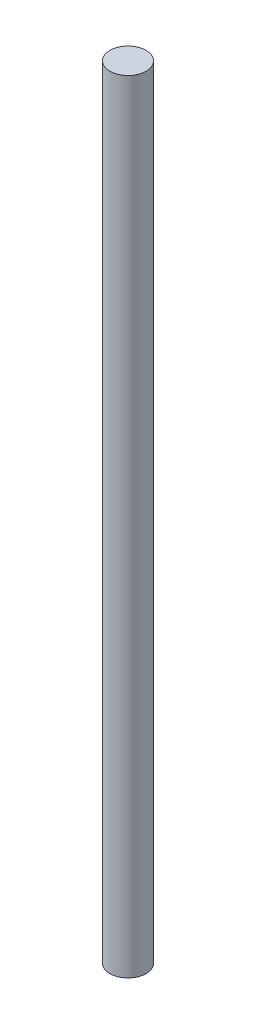
ISO-10303-21;
HEADER;
FILE_DESCRIPTION(('STEP AP214'),'2;1');
FILE_NAME('part.step','',(''),(''),'','','');
FILE_SCHEMA(('AUTOMOTIVE_DESIGN { 1 0 10303 214 1 1 1 1 }'));
ENDSEC;
DATA;
#1=APPLICATION_CONTEXT('core data for automotive mechanical design processes');
#2=APPLICATION_PROTOCOL_DEFINITION('international standard','automotive_design',2000,#1);
#3=PRODUCT_CONTEXT('',#1,'mechanical');
#4=PRODUCT('Part','Part','',(#3));
#5=PRODUCT_RELATED_PRODUCT_CATEGORY('part','',(#4));
#6=PRODUCT_DEFINITION_FORMATION('','',#4);
#7=PRODUCT_DEFINITION_CONTEXT('part definition',#1,'design');
#8=PRODUCT_DEFINITION('design','',#6,#7);
#9=PRODUCT_DEFINITION_SHAPE('','',#8);
#10=(LENGTH_UNIT() NAMED_UNIT(*) SI_UNIT(.MILLI.,.METRE.));
#11=(NAMED_UNIT(*) PLANE_ANGLE_UNIT() SI_UNIT($,.RADIAN.));
#12=(NAMED_UNIT(*) SI_UNIT($,.STERADIAN.) SOLID_ANGLE_UNIT());
#13=UNCERTAINTY_MEASURE_WITH_UNIT(LENGTH_MEASURE(1.E-05),#10,'distance_accuracy_value','');
#14=(GEOMETRIC_REPRESENTATION_CONTEXT(3) GLOBAL_UNCERTAINTY_ASSIGNED_CONTEXT((#13)) GLOBAL_UNIT_ASSIGNED_CONTEXT((#10,
#11,#12)) REPRESENTATION_CONTEXT('',''));
#15=CARTESIAN_POINT('',(0.,0.,0.));
#16=DIRECTION('',(0.,0.,1.));
#17=DIRECTION('',(1.,0.,0.));
#18=AXIS2_PLACEMENT_3D('',#15,#16,#17);
#19=CARTESIAN_POINT('',(0.,685.8,0.));
#20=DIRECTION('',(0.,1.,0.));
#21=DIRECTION('',(0.,0.,1.));
#22=AXIS2_PLACEMENT_3D('',#19,#20,#21);
#23=PLANE('',#22);
#24=CARTESIAN_POINT('',(0.,685.8,0.));
#25=DIRECTION('',(0.,1.,0.));
#26=DIRECTION('',(0.,0.,1.));
#27=AXIS2_PLACEMENT_3D('',#24,#25,#26);
#28=CIRCLE('',#27,31.75);
#29=CARTESIAN_POINT('',(0.,685.8,31.75));
#30=VERTEX_POINT('',#29);
#31=EDGE_CURVE('E17',#30,#30,#28,.F.);
#32=ORIENTED_EDGE('',*,*,#31,.F.);
#33=EDGE_LOOP('',(#32));
#34=FACE_BOUND('',#33,.T.);
#35=ADVANCED_FACE('F14',(#34),#23,.T.);
#36=CARTESIAN_POINT('',(0.,-685.8,0.));
#37=DIRECTION('',(0.,1.,0.));
#38=DIRECTION('',(0.,0.,1.));
#39=AXIS2_PLACEMENT_3D('',#36,#37,#38);
#40=PLANE('',#39);
#41=CARTESIAN_POINT('',(0.,-685.8,0.));
#42=DIRECTION('',(0.,1.,0.));
#43=DIRECTION('',(0.,0.,1.));
#44=AXIS2_PLACEMENT_3D('',#41,#42,#43);
#45=CIRCLE('',#44,31.75);
#46=CARTESIAN_POINT('',(0.,-685.8,31.75));
#47=VERTEX_POINT('',#46);
#48=EDGE_CURVE('E10',#47,#47,#45,.T.);
#49=ORIENTED_EDGE('',*,*,#48,.F.);
#50=EDGE_LOOP('',(#49));
#51=FACE_BOUND('',#50,.T.);
#52=ADVANCED_FACE('F29',(#51),#40,.F.);
#53=CARTESIAN_POINT('',(0.,-685.8,0.));
#54=DIRECTION('',(0.,1.,0.));
#55=DIRECTION('',(0.,0.,1.));
#56=AXIS2_PLACEMENT_3D('',#53,#54,#55);
#57=CYLINDRICAL_SURFACE('',#56,31.75);
#58=ORIENTED_EDGE('',*,*,#31,.T.);
#59=EDGE_LOOP('',(#58));
#60=FACE_BOUND('',#59,.T.);
#61=ORIENTED_EDGE('',*,*,#48,.T.);
#62=EDGE_LOOP('',(#61));
#63=FACE_BOUND('',#62,.T.);
#64=ADVANCED_FACE('F26',(#60,#63),#57,.T.);
#65=CLOSED_SHELL('',(#35,#52,#64));
#66=MANIFOLD_SOLID_BREP('B1',#65);
#67=ADVANCED_BREP_SHAPE_REPRESENTATION('',(#18,#66),#14);
#68=SHAPE_DEFINITION_REPRESENTATION(#9,#67);
ENDSEC;
END-ISO-10303-21;
